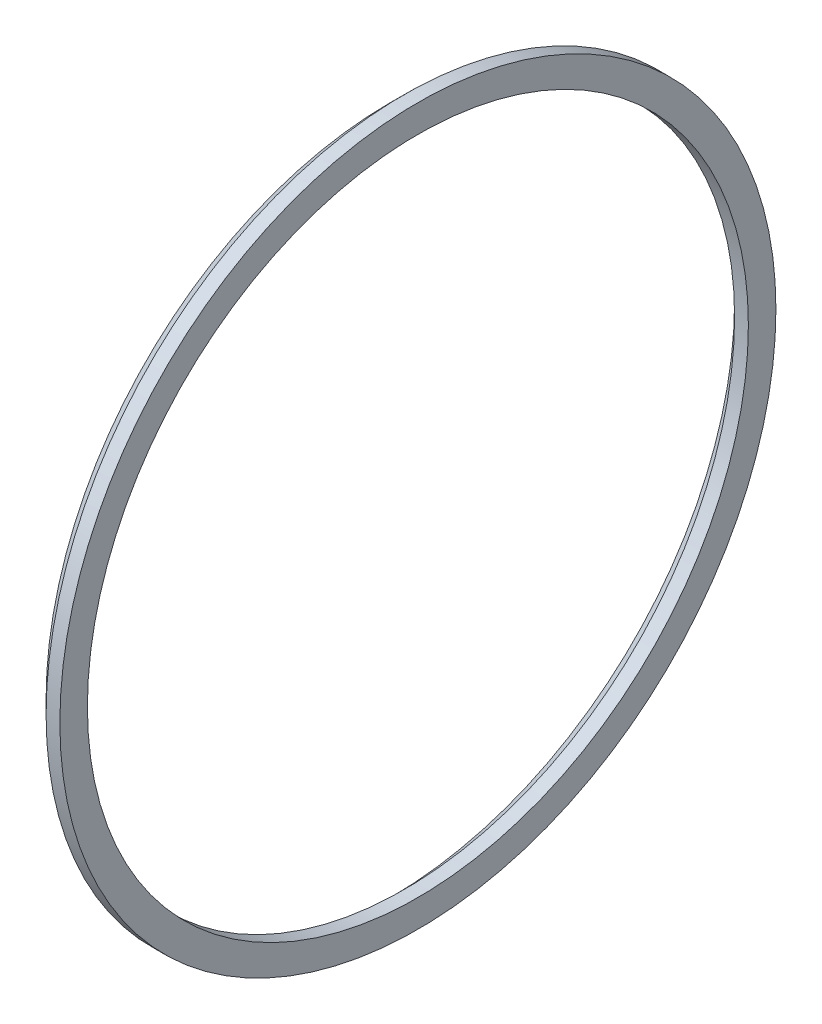
ISO-10303-21;
HEADER;
FILE_DESCRIPTION(('STEP AP214'),'2;1');
FILE_NAME('part.step','',(''),(''),'','','');
FILE_SCHEMA(('AUTOMOTIVE_DESIGN { 1 0 10303 214 1 1 1 1 }'));
ENDSEC;
DATA;
#1=APPLICATION_CONTEXT('core data for automotive mechanical design processes');
#2=APPLICATION_PROTOCOL_DEFINITION('international standard','automotive_design',2000,#1);
#3=PRODUCT_CONTEXT('',#1,'mechanical');
#4=PRODUCT('Part','Part','',(#3));
#5=PRODUCT_RELATED_PRODUCT_CATEGORY('part','',(#4));
#6=PRODUCT_DEFINITION_FORMATION('','',#4);
#7=PRODUCT_DEFINITION_CONTEXT('part definition',#1,'design');
#8=PRODUCT_DEFINITION('design','',#6,#7);
#9=PRODUCT_DEFINITION_SHAPE('','',#8);
#10=(LENGTH_UNIT() NAMED_UNIT(*) SI_UNIT(.MILLI.,.METRE.));
#11=(NAMED_UNIT(*) PLANE_ANGLE_UNIT() SI_UNIT($,.RADIAN.));
#12=(NAMED_UNIT(*) SI_UNIT($,.STERADIAN.) SOLID_ANGLE_UNIT());
#13=UNCERTAINTY_MEASURE_WITH_UNIT(LENGTH_MEASURE(1.E-05),#10,'distance_accuracy_value','');
#14=(GEOMETRIC_REPRESENTATION_CONTEXT(3) GLOBAL_UNCERTAINTY_ASSIGNED_CONTEXT((#13)) GLOBAL_UNIT_ASSIGNED_CONTEXT((#10,
#11,#12)) REPRESENTATION_CONTEXT('',''));
#15=CARTESIAN_POINT('',(0.,0.,0.));
#16=DIRECTION('',(0.,0.,1.));
#17=DIRECTION('',(1.,0.,0.));
#18=AXIS2_PLACEMENT_3D('',#15,#16,#17);
#19=CARTESIAN_POINT('',(1.,0.,0.));
#20=DIRECTION('',(1.,0.,0.));
#21=DIRECTION('',(0.,0.,-1.));
#22=AXIS2_PLACEMENT_3D('',#19,#20,#21);
#23=PLANE('',#22);
#24=CARTESIAN_POINT('',(1.,0.,0.));
#25=DIRECTION('',(1.,0.,0.));
#26=DIRECTION('',(0.,0.,-1.));
#27=AXIS2_PLACEMENT_3D('',#24,#25,#26);
#28=CIRCLE('',#27,13.);
#29=CARTESIAN_POINT('',(1.,0.,-13.));
#30=VERTEX_POINT('',#29);
#31=EDGE_CURVE('E52',#30,#30,#28,.T.);
#32=ORIENTED_EDGE('',*,*,#31,.T.);
#33=EDGE_LOOP('',(#32));
#34=FACE_BOUND('',#33,.T.);
#35=CARTESIAN_POINT('',(1.,0.,0.));
#36=DIRECTION('',(1.,0.,0.));
#37=DIRECTION('',(0.,0.,-1.));
#38=AXIS2_PLACEMENT_3D('',#35,#36,#37);
#39=CIRCLE('',#38,12.);
#40=CARTESIAN_POINT('',(1.,0.,-12.));
#41=VERTEX_POINT('',#40);
#42=EDGE_CURVE('E57',#41,#41,#39,.T.);
#43=ORIENTED_EDGE('',*,*,#42,.F.);
#44=EDGE_LOOP('',(#43));
#45=FACE_BOUND('',#44,.T.);
#46=ADVANCED_FACE('F39',(#34,#45),#23,.T.);
#47=CARTESIAN_POINT('',(1.,0.,0.));
#48=DIRECTION('',(-1.,0.,0.));
#49=DIRECTION('',(0.,0.,1.));
#50=AXIS2_PLACEMENT_3D('',#47,#48,#49);
#51=CYLINDRICAL_SURFACE('',#50,13.);
#52=CARTESIAN_POINT('',(0.500000000000004,0.,0.));
#53=DIRECTION('',(1.,0.,0.));
#54=DIRECTION('',(0.,0.,-1.));
#55=AXIS2_PLACEMENT_3D('',#52,#53,#54);
#56=CIRCLE('',#55,13.);
#57=CARTESIAN_POINT('',(0.500000000000004,0.,-13.));
#58=VERTEX_POINT('',#57);
#59=EDGE_CURVE('E48',#58,#58,#56,.T.);
#60=ORIENTED_EDGE('',*,*,#59,.T.);
#61=EDGE_LOOP('',(#60));
#62=FACE_BOUND('',#61,.T.);
#63=ORIENTED_EDGE('',*,*,#31,.F.);
#64=EDGE_LOOP('',(#63));
#65=FACE_BOUND('',#64,.T.);
#66=ADVANCED_FACE('F74',(#62,#65),#51,.T.);
#67=CARTESIAN_POINT('',(1.,0.,0.));
#68=DIRECTION('',(-1.,0.,0.));
#69=DIRECTION('',(0.,0.,1.));
#70=AXIS2_PLACEMENT_3D('',#67,#68,#69);
#71=CYLINDRICAL_SURFACE('',#70,12.);
#72=CARTESIAN_POINT('',(0.499999999999999,0.,0.));
#73=DIRECTION('',(1.,0.,0.));
#74=DIRECTION('',(0.,0.,-1.));
#75=AXIS2_PLACEMENT_3D('',#72,#73,#74);
#76=CIRCLE('',#75,12.);
#77=CARTESIAN_POINT('',(0.499999999999999,0.,-12.));
#78=VERTEX_POINT('',#77);
#79=EDGE_CURVE('E10',#78,#78,#76,.F.);
#80=ORIENTED_EDGE('',*,*,#79,.T.);
#81=EDGE_LOOP('',(#80));
#82=FACE_BOUND('',#81,.T.);
#83=ORIENTED_EDGE('',*,*,#42,.T.);
#84=EDGE_LOOP('',(#83));
#85=FACE_BOUND('',#84,.T.);
#86=ADVANCED_FACE('F68',(#82,#85),#71,.F.);
#87=CARTESIAN_POINT('',(0.,0.,0.));
#88=DIRECTION('',(-1.,0.,0.));
#89=DIRECTION('',(0.,0.,1.));
#90=AXIS2_PLACEMENT_3D('',#87,#88,#89);
#91=CONICAL_SURFACE('',#90,12.5,0.785398163397445);
#92=ORIENTED_EDGE('',*,*,#79,.F.);
#93=EDGE_LOOP('',(#92));
#94=FACE_BOUND('',#93,.T.);
#95=CARTESIAN_POINT('',(0.,0.,0.));
#96=DIRECTION('',(1.,0.,0.));
#97=DIRECTION('',(0.,0.,-1.));
#98=AXIS2_PLACEMENT_3D('',#95,#96,#97);
#99=CIRCLE('',#98,12.5);
#100=CARTESIAN_POINT('',(0.,0.,-12.5));
#101=VERTEX_POINT('',#100);
#102=EDGE_CURVE('E44',#101,#101,#99,.T.);
#103=ORIENTED_EDGE('',*,*,#102,.F.);
#104=EDGE_LOOP('',(#103));
#105=FACE_BOUND('',#104,.T.);
#106=ADVANCED_FACE('F42',(#94,#105),#91,.F.);
#107=CARTESIAN_POINT('',(0.500000000000004,0.,0.));
#108=DIRECTION('',(1.,0.,0.));
#109=DIRECTION('',(0.,0.,-1.));
#110=AXIS2_PLACEMENT_3D('',#107,#108,#109);
#111=CONICAL_SURFACE('',#110,13.,0.785398163397448);
#112=ORIENTED_EDGE('',*,*,#102,.T.);
#113=EDGE_LOOP('',(#112));
#114=FACE_BOUND('',#113,.T.);
#115=ORIENTED_EDGE('',*,*,#59,.F.);
#116=EDGE_LOOP('',(#115));
#117=FACE_BOUND('',#116,.T.);
#118=ADVANCED_FACE('F64',(#114,#117),#111,.T.);
#119=CLOSED_SHELL('',(#46,#66,#86,#106,#118));
#120=MANIFOLD_SOLID_BREP('B2',#119);
#121=ADVANCED_BREP_SHAPE_REPRESENTATION('',(#18,#120),#14);
#122=SHAPE_DEFINITION_REPRESENTATION(#9,#121);
ENDSEC;
END-ISO-10303-21;
